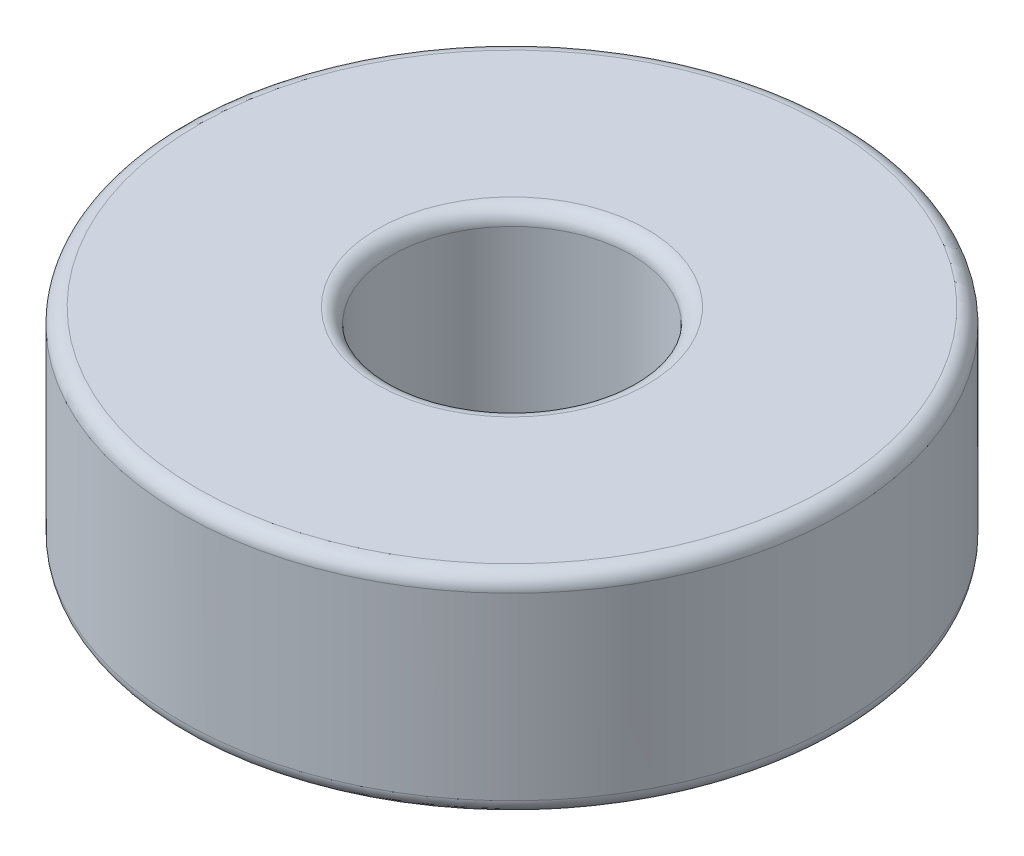
ISO-10303-21;
HEADER;
FILE_DESCRIPTION(('STEP AP214'),'2;1');
FILE_NAME('part.step','',(''),(''),'','','');
FILE_SCHEMA(('AUTOMOTIVE_DESIGN { 1 0 10303 214 1 1 1 1 }'));
ENDSEC;
DATA;
#1=APPLICATION_CONTEXT('core data for automotive mechanical design processes');
#2=APPLICATION_PROTOCOL_DEFINITION('international standard','automotive_design',2000,#1);
#3=PRODUCT_CONTEXT('',#1,'mechanical');
#4=PRODUCT('Part','Part','',(#3));
#5=PRODUCT_RELATED_PRODUCT_CATEGORY('part','',(#4));
#6=PRODUCT_DEFINITION_FORMATION('','',#4);
#7=PRODUCT_DEFINITION_CONTEXT('part definition',#1,'design');
#8=PRODUCT_DEFINITION('design','',#6,#7);
#9=PRODUCT_DEFINITION_SHAPE('','',#8);
#10=(LENGTH_UNIT() NAMED_UNIT(*) SI_UNIT(.MILLI.,.METRE.));
#11=(NAMED_UNIT(*) PLANE_ANGLE_UNIT() SI_UNIT($,.RADIAN.));
#12=(NAMED_UNIT(*) SI_UNIT($,.STERADIAN.) SOLID_ANGLE_UNIT());
#13=UNCERTAINTY_MEASURE_WITH_UNIT(LENGTH_MEASURE(1.E-05),#10,'distance_accuracy_value','');
#14=(GEOMETRIC_REPRESENTATION_CONTEXT(3) GLOBAL_UNCERTAINTY_ASSIGNED_CONTEXT((#13)) GLOBAL_UNIT_ASSIGNED_CONTEXT((#10,
#11,#12)) REPRESENTATION_CONTEXT('',''));
#15=CARTESIAN_POINT('',(0.,0.,0.));
#16=DIRECTION('',(0.,0.,1.));
#17=DIRECTION('',(1.,0.,0.));
#18=AXIS2_PLACEMENT_3D('',#15,#16,#17);
#19=CARTESIAN_POINT('',(0.,0.,0.));
#20=DIRECTION('',(0.,-1.,0.));
#21=DIRECTION('',(0.,0.,-1.));
#22=AXIS2_PLACEMENT_3D('',#19,#20,#21);
#23=CYLINDRICAL_SURFACE('',#22,4.);
#24=CARTESIAN_POINT('',(0.,0.5,0.));
#25=DIRECTION('',(0.,-1.,0.));
#26=DIRECTION('',(0.,0.,-1.));
#27=AXIS2_PLACEMENT_3D('',#24,#25,#26);
#28=CIRCLE('',#27,4.);
#29=CARTESIAN_POINT('',(0.,0.5,-4.));
#30=VERTEX_POINT('',#29);
#31=EDGE_CURVE('E56',#30,#30,#28,.T.);
#32=ORIENTED_EDGE('',*,*,#31,.T.);
#33=EDGE_LOOP('',(#32));
#34=FACE_BOUND('',#33,.T.);
#35=CARTESIAN_POINT('',(0.,6.5,0.));
#36=DIRECTION('',(0.,1.,0.));
#37=DIRECTION('',(0.,0.,1.));
#38=AXIS2_PLACEMENT_3D('',#35,#36,#37);
#39=CIRCLE('',#38,4.);
#40=CARTESIAN_POINT('',(0.,6.5,4.));
#41=VERTEX_POINT('',#40);
#42=EDGE_CURVE('E59',#41,#41,#39,.T.);
#43=ORIENTED_EDGE('',*,*,#42,.T.);
#44=EDGE_LOOP('',(#43));
#45=FACE_BOUND('',#44,.T.);
#46=ADVANCED_FACE('F30',(#34,#45),#23,.F.);
#47=CARTESIAN_POINT('',(4.,7.,0.));
#48=DIRECTION('',(0.,1.,0.));
#49=DIRECTION('',(0.,0.,1.));
#50=AXIS2_PLACEMENT_3D('',#47,#48,#49);
#51=PLANE('',#50);
#52=CARTESIAN_POINT('',(0.,7.,0.));
#53=DIRECTION('',(0.,1.,0.));
#54=DIRECTION('',(0.,0.,1.));
#55=AXIS2_PLACEMENT_3D('',#52,#53,#54);
#56=CIRCLE('',#55,10.5);
#57=CARTESIAN_POINT('',(0.,7.,10.5));
#58=VERTEX_POINT('',#57);
#59=EDGE_CURVE('E10',#58,#58,#56,.T.);
#60=ORIENTED_EDGE('',*,*,#59,.T.);
#61=EDGE_LOOP('',(#60));
#62=FACE_BOUND('',#61,.T.);
#63=CARTESIAN_POINT('',(0.,7.,0.));
#64=DIRECTION('',(0.,1.,0.));
#65=DIRECTION('',(0.,0.,1.));
#66=AXIS2_PLACEMENT_3D('',#63,#64,#65);
#67=CIRCLE('',#66,4.5);
#68=CARTESIAN_POINT('',(0.,7.,4.5));
#69=VERTEX_POINT('',#68);
#70=EDGE_CURVE('E37',#69,#69,#67,.F.);
#71=ORIENTED_EDGE('',*,*,#70,.T.);
#72=EDGE_LOOP('',(#71));
#73=FACE_BOUND('',#72,.T.);
#74=ADVANCED_FACE('F73',(#62,#73),#51,.T.);
#75=CARTESIAN_POINT('',(0.,0.,0.));
#76=DIRECTION('',(0.,-1.,0.));
#77=DIRECTION('',(0.,0.,-1.));
#78=AXIS2_PLACEMENT_3D('',#75,#76,#77);
#79=CYLINDRICAL_SURFACE('',#78,11.);
#80=CARTESIAN_POINT('',(0.,0.5,0.));
#81=DIRECTION('',(0.,-1.,0.));
#82=DIRECTION('',(0.,0.,-1.));
#83=AXIS2_PLACEMENT_3D('',#80,#81,#82);
#84=CIRCLE('',#83,11.);
#85=CARTESIAN_POINT('',(0.,0.5,-11.));
#86=VERTEX_POINT('',#85);
#87=EDGE_CURVE('E41',#86,#86,#84,.F.);
#88=ORIENTED_EDGE('',*,*,#87,.T.);
#89=EDGE_LOOP('',(#88));
#90=FACE_BOUND('',#89,.T.);
#91=CARTESIAN_POINT('',(0.,6.5,0.));
#92=DIRECTION('',(0.,1.,0.));
#93=DIRECTION('',(0.,0.,1.));
#94=AXIS2_PLACEMENT_3D('',#91,#92,#93);
#95=CIRCLE('',#94,11.);
#96=CARTESIAN_POINT('',(0.,6.5,11.));
#97=VERTEX_POINT('',#96);
#98=EDGE_CURVE('E45',#97,#97,#95,.F.);
#99=ORIENTED_EDGE('',*,*,#98,.T.);
#100=EDGE_LOOP('',(#99));
#101=FACE_BOUND('',#100,.T.);
#102=ADVANCED_FACE('F79',(#90,#101),#79,.T.);
#103=CARTESIAN_POINT('',(4.,0.,0.));
#104=DIRECTION('',(0.,-1.,0.));
#105=DIRECTION('',(0.,0.,-1.));
#106=AXIS2_PLACEMENT_3D('',#103,#104,#105);
#107=PLANE('',#106);
#108=CARTESIAN_POINT('',(0.,0.,0.));
#109=DIRECTION('',(0.,-1.,0.));
#110=DIRECTION('',(0.,0.,-1.));
#111=AXIS2_PLACEMENT_3D('',#108,#109,#110);
#112=CIRCLE('',#111,4.5);
#113=CARTESIAN_POINT('',(0.,0.,-4.5));
#114=VERTEX_POINT('',#113);
#115=EDGE_CURVE('E50',#114,#114,#112,.F.);
#116=ORIENTED_EDGE('',*,*,#115,.T.);
#117=EDGE_LOOP('',(#116));
#118=FACE_BOUND('',#117,.T.);
#119=CARTESIAN_POINT('',(0.,0.,0.));
#120=DIRECTION('',(0.,-1.,0.));
#121=DIRECTION('',(0.,0.,-1.));
#122=AXIS2_PLACEMENT_3D('',#119,#120,#121);
#123=CIRCLE('',#122,10.5);
#124=CARTESIAN_POINT('',(0.,0.,-10.5));
#125=VERTEX_POINT('',#124);
#126=EDGE_CURVE('E53',#125,#125,#123,.T.);
#127=ORIENTED_EDGE('',*,*,#126,.T.);
#128=EDGE_LOOP('',(#127));
#129=FACE_BOUND('',#128,.T.);
#130=ADVANCED_FACE('F86',(#118,#129),#107,.T.);
#131=CARTESIAN_POINT('',(0.,0.5,0.));
#132=DIRECTION('',(0.,-1.,0.));
#133=DIRECTION('',(0.,0.,-1.));
#134=AXIS2_PLACEMENT_3D('',#131,#132,#133);
#135=TOROIDAL_SURFACE('',#134,4.5,0.5);
#136=ORIENTED_EDGE('',*,*,#115,.F.);
#137=EDGE_LOOP('',(#136));
#138=FACE_BOUND('',#137,.T.);
#139=ORIENTED_EDGE('',*,*,#31,.F.);
#140=EDGE_LOOP('',(#139));
#141=FACE_BOUND('',#140,.T.);
#142=ADVANCED_FACE('F83',(#138,#141),#135,.T.);
#143=CARTESIAN_POINT('',(0.,0.5,0.));
#144=DIRECTION('',(0.,-1.,0.));
#145=DIRECTION('',(0.,0.,-1.));
#146=AXIS2_PLACEMENT_3D('',#143,#144,#145);
#147=TOROIDAL_SURFACE('',#146,10.5,0.5);
#148=ORIENTED_EDGE('',*,*,#87,.F.);
#149=EDGE_LOOP('',(#148));
#150=FACE_BOUND('',#149,.T.);
#151=ORIENTED_EDGE('',*,*,#126,.F.);
#152=EDGE_LOOP('',(#151));
#153=FACE_BOUND('',#152,.T.);
#154=ADVANCED_FACE('F70',(#150,#153),#147,.T.);
#155=CARTESIAN_POINT('',(0.,6.5,0.));
#156=DIRECTION('',(0.,1.,0.));
#157=DIRECTION('',(0.,0.,1.));
#158=AXIS2_PLACEMENT_3D('',#155,#156,#157);
#159=TOROIDAL_SURFACE('',#158,10.5,0.5);
#160=ORIENTED_EDGE('',*,*,#59,.F.);
#161=EDGE_LOOP('',(#160));
#162=FACE_BOUND('',#161,.T.);
#163=ORIENTED_EDGE('',*,*,#98,.F.);
#164=EDGE_LOOP('',(#163));
#165=FACE_BOUND('',#164,.T.);
#166=ADVANCED_FACE('F66',(#162,#165),#159,.T.);
#167=CARTESIAN_POINT('',(0.,6.5,0.));
#168=DIRECTION('',(0.,1.,0.));
#169=DIRECTION('',(0.,0.,1.));
#170=AXIS2_PLACEMENT_3D('',#167,#168,#169);
#171=TOROIDAL_SURFACE('',#170,4.5,0.5);
#172=ORIENTED_EDGE('',*,*,#42,.F.);
#173=EDGE_LOOP('',(#172));
#174=FACE_BOUND('',#173,.T.);
#175=ORIENTED_EDGE('',*,*,#70,.F.);
#176=EDGE_LOOP('',(#175));
#177=FACE_BOUND('',#176,.T.);
#178=ADVANCED_FACE('F32',(#174,#177),#171,.T.);
#179=CLOSED_SHELL('',(#46,#74,#102,#130,#142,#154,#166,#178));
#180=MANIFOLD_SOLID_BREP('B2',#179);
#181=ADVANCED_BREP_SHAPE_REPRESENTATION('',(#18,#180),#14);
#182=SHAPE_DEFINITION_REPRESENTATION(#9,#181);
ENDSEC;
END-ISO-10303-21;
